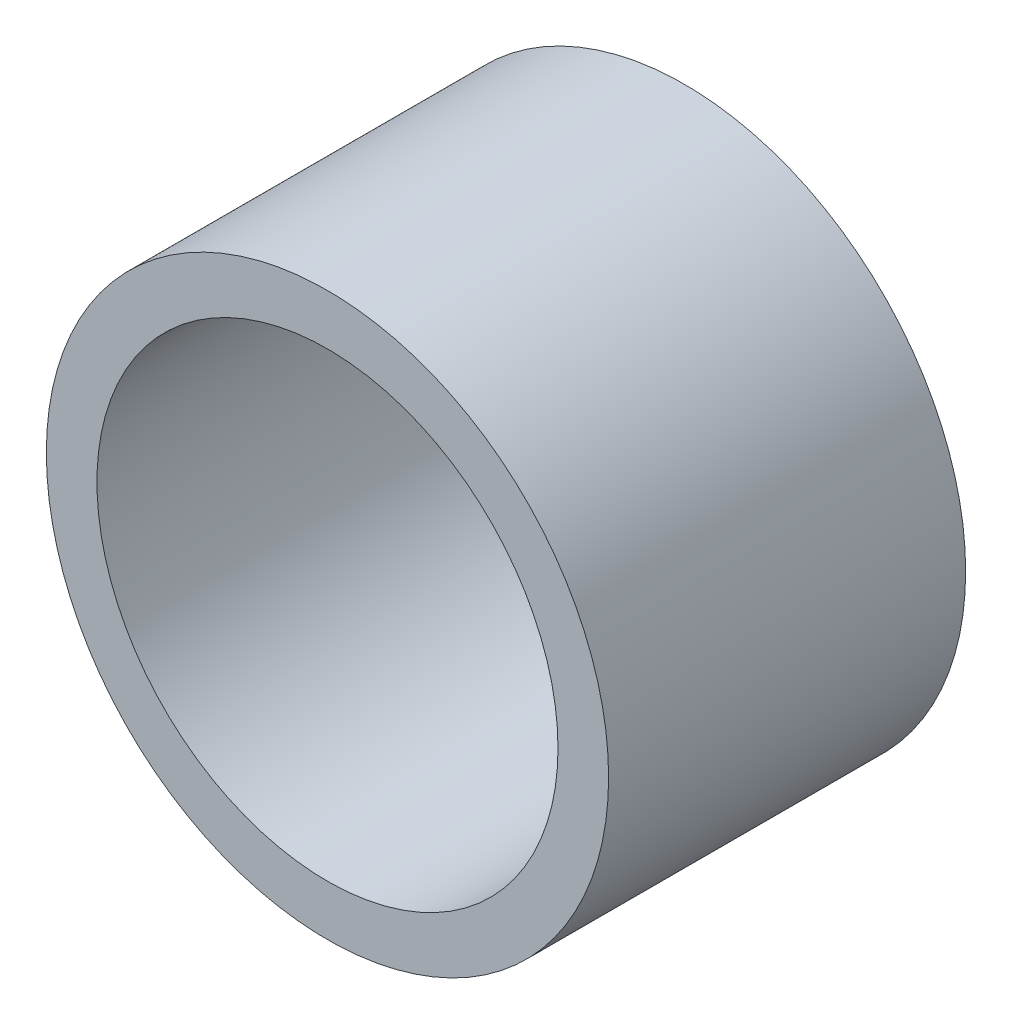
ISO-10303-21;
HEADER;
FILE_DESCRIPTION(('STEP AP214'),'2;1');
FILE_NAME('part.step','',(''),(''),'','','');
FILE_SCHEMA(('AUTOMOTIVE_DESIGN { 1 0 10303 214 1 1 1 1 }'));
ENDSEC;
DATA;
#1=APPLICATION_CONTEXT('core data for automotive mechanical design processes');
#2=APPLICATION_PROTOCOL_DEFINITION('international standard','automotive_design',2000,#1);
#3=PRODUCT_CONTEXT('',#1,'mechanical');
#4=PRODUCT('Part','Part','',(#3));
#5=PRODUCT_RELATED_PRODUCT_CATEGORY('part','',(#4));
#6=PRODUCT_DEFINITION_FORMATION('','',#4);
#7=PRODUCT_DEFINITION_CONTEXT('part definition',#1,'design');
#8=PRODUCT_DEFINITION('design','',#6,#7);
#9=PRODUCT_DEFINITION_SHAPE('','',#8);
#10=(LENGTH_UNIT() NAMED_UNIT(*) SI_UNIT(.MILLI.,.METRE.));
#11=(NAMED_UNIT(*) PLANE_ANGLE_UNIT() SI_UNIT($,.RADIAN.));
#12=(NAMED_UNIT(*) SI_UNIT($,.STERADIAN.) SOLID_ANGLE_UNIT());
#13=UNCERTAINTY_MEASURE_WITH_UNIT(LENGTH_MEASURE(1.E-05),#10,'distance_accuracy_value','');
#14=(GEOMETRIC_REPRESENTATION_CONTEXT(3) GLOBAL_UNCERTAINTY_ASSIGNED_CONTEXT((#13)) GLOBAL_UNIT_ASSIGNED_CONTEXT((#10,
#11,#12)) REPRESENTATION_CONTEXT('',''));
#15=CARTESIAN_POINT('',(0.,0.,0.));
#16=DIRECTION('',(0.,0.,1.));
#17=DIRECTION('',(1.,0.,0.));
#18=AXIS2_PLACEMENT_3D('',#15,#16,#17);
#19=CARTESIAN_POINT('',(0.,0.,6.35));
#20=DIRECTION('',(0.,0.,-1.));
#21=DIRECTION('',(-1.,0.,0.));
#22=AXIS2_PLACEMENT_3D('',#19,#20,#21);
#23=CYLINDRICAL_SURFACE('',#22,5.);
#24=CARTESIAN_POINT('',(0.,0.,6.35));
#25=DIRECTION('',(0.,0.,1.));
#26=DIRECTION('',(1.,0.,0.));
#27=AXIS2_PLACEMENT_3D('',#24,#25,#26);
#28=CIRCLE('',#27,5.);
#29=CARTESIAN_POINT('',(5.,0.,6.35));
#30=VERTEX_POINT('',#29);
#31=EDGE_CURVE('E10',#30,#30,#28,.T.);
#32=ORIENTED_EDGE('',*,*,#31,.F.);
#33=EDGE_LOOP('',(#32));
#34=FACE_BOUND('',#33,.T.);
#35=CARTESIAN_POINT('',(0.,0.,0.));
#36=DIRECTION('',(0.,0.,1.));
#37=DIRECTION('',(1.,0.,0.));
#38=AXIS2_PLACEMENT_3D('',#35,#36,#37);
#39=CIRCLE('',#38,5.);
#40=CARTESIAN_POINT('',(5.,0.,0.));
#41=VERTEX_POINT('',#40);
#42=EDGE_CURVE('E40',#41,#41,#39,.T.);
#43=ORIENTED_EDGE('',*,*,#42,.T.);
#44=EDGE_LOOP('',(#43));
#45=FACE_BOUND('',#44,.T.);
#46=ADVANCED_FACE('F37',(#34,#45),#23,.T.);
#47=CARTESIAN_POINT('',(0.,0.,6.35));
#48=DIRECTION('',(0.,0.,1.));
#49=DIRECTION('',(1.,0.,0.));
#50=AXIS2_PLACEMENT_3D('',#47,#48,#49);
#51=PLANE('',#50);
#52=CARTESIAN_POINT('',(0.,0.,6.35));
#53=DIRECTION('',(0.,0.,1.));
#54=DIRECTION('',(1.,0.,0.));
#55=AXIS2_PLACEMENT_3D('',#52,#53,#54);
#56=CIRCLE('',#55,4.1);
#57=CARTESIAN_POINT('',(4.1,0.,6.35));
#58=VERTEX_POINT('',#57);
#59=EDGE_CURVE('E51',#58,#58,#56,.T.);
#60=ORIENTED_EDGE('',*,*,#59,.F.);
#61=EDGE_LOOP('',(#60));
#62=FACE_BOUND('',#61,.T.);
#63=ORIENTED_EDGE('',*,*,#31,.T.);
#64=EDGE_LOOP('',(#63));
#65=FACE_BOUND('',#64,.T.);
#66=ADVANCED_FACE('F68',(#62,#65),#51,.T.);
#67=CARTESIAN_POINT('',(0.,0.,0.));
#68=DIRECTION('',(0.,0.,1.));
#69=DIRECTION('',(1.,0.,0.));
#70=AXIS2_PLACEMENT_3D('',#67,#68,#69);
#71=PLANE('',#70);
#72=CARTESIAN_POINT('',(0.,0.,0.));
#73=DIRECTION('',(0.,0.,1.));
#74=DIRECTION('',(1.,0.,0.));
#75=AXIS2_PLACEMENT_3D('',#72,#73,#74);
#76=CIRCLE('',#75,4.1);
#77=CARTESIAN_POINT('',(4.1,0.,0.));
#78=VERTEX_POINT('',#77);
#79=EDGE_CURVE('E49',#78,#78,#76,.T.);
#80=ORIENTED_EDGE('',*,*,#79,.T.);
#81=EDGE_LOOP('',(#80));
#82=FACE_BOUND('',#81,.T.);
#83=ORIENTED_EDGE('',*,*,#42,.F.);
#84=EDGE_LOOP('',(#83));
#85=FACE_BOUND('',#84,.T.);
#86=ADVANCED_FACE('F59',(#82,#85),#71,.F.);
#87=CARTESIAN_POINT('',(0.,0.,0.));
#88=DIRECTION('',(0.,0.,1.));
#89=DIRECTION('',(1.,0.,0.));
#90=AXIS2_PLACEMENT_3D('',#87,#88,#89);
#91=CYLINDRICAL_SURFACE('',#90,4.1);
#92=ORIENTED_EDGE('',*,*,#79,.F.);
#93=EDGE_LOOP('',(#92));
#94=FACE_BOUND('',#93,.T.);
#95=ORIENTED_EDGE('',*,*,#59,.T.);
#96=EDGE_LOOP('',(#95));
#97=FACE_BOUND('',#96,.T.);
#98=ADVANCED_FACE('F62',(#94,#97),#91,.F.);
#99=CLOSED_SHELL('',(#46,#66,#86,#98));
#100=MANIFOLD_SOLID_BREP('B2',#99);
#101=ADVANCED_BREP_SHAPE_REPRESENTATION('',(#18,#100),#14);
#102=SHAPE_DEFINITION_REPRESENTATION(#9,#101);
ENDSEC;
END-ISO-10303-21;
